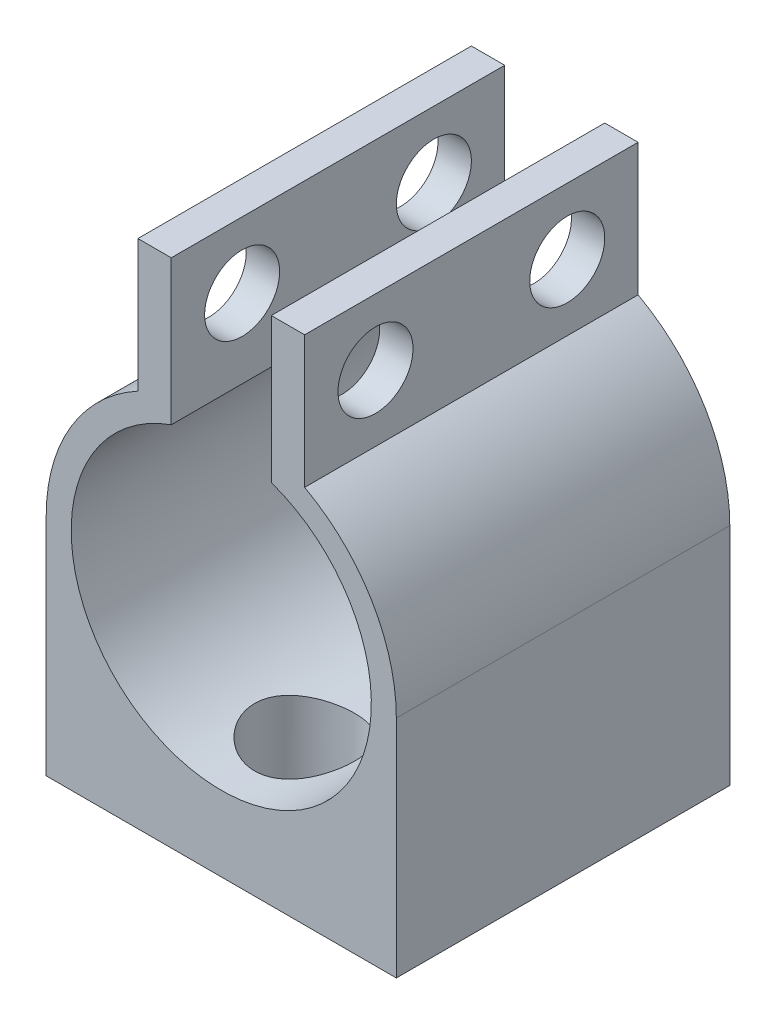
ISO-10303-21;
HEADER;
FILE_DESCRIPTION(('STEP AP214'),'2;1');
FILE_NAME('part.step','',(''),(''),'','','');
FILE_SCHEMA(('AUTOMOTIVE_DESIGN { 1 0 10303 214 1 1 1 1 }'));
ENDSEC;
DATA;
#1=APPLICATION_CONTEXT('core data for automotive mechanical design processes');
#2=APPLICATION_PROTOCOL_DEFINITION('international standard','automotive_design',2000,#1);
#3=PRODUCT_CONTEXT('',#1,'mechanical');
#4=PRODUCT('Part','Part','',(#3));
#5=PRODUCT_RELATED_PRODUCT_CATEGORY('part','',(#4));
#6=PRODUCT_DEFINITION_FORMATION('','',#4);
#7=PRODUCT_DEFINITION_CONTEXT('part definition',#1,'design');
#8=PRODUCT_DEFINITION('design','',#6,#7);
#9=PRODUCT_DEFINITION_SHAPE('','',#8);
#10=(LENGTH_UNIT() NAMED_UNIT(*) SI_UNIT(.MILLI.,.METRE.));
#11=(NAMED_UNIT(*) PLANE_ANGLE_UNIT() SI_UNIT($,.RADIAN.));
#12=(NAMED_UNIT(*) SI_UNIT($,.STERADIAN.) SOLID_ANGLE_UNIT());
#13=UNCERTAINTY_MEASURE_WITH_UNIT(LENGTH_MEASURE(1.E-05),#10,'distance_accuracy_value','');
#14=(GEOMETRIC_REPRESENTATION_CONTEXT(3) GLOBAL_UNCERTAINTY_ASSIGNED_CONTEXT((#13)) GLOBAL_UNIT_ASSIGNED_CONTEXT((#10,
#11,#12)) REPRESENTATION_CONTEXT('',''));
#15=CARTESIAN_POINT('',(0.,0.,0.));
#16=DIRECTION('',(0.,0.,1.));
#17=DIRECTION('',(1.,0.,0.));
#18=AXIS2_PLACEMENT_3D('',#15,#16,#17);
#19=CARTESIAN_POINT('',(0.,0.,20.));
#20=DIRECTION('',(0.,0.,-1.));
#21=DIRECTION('',(-1.,0.,0.));
#22=AXIS2_PLACEMENT_3D('',#19,#20,#21);
#23=CYLINDRICAL_SURFACE('',#22,9.);
#24=CARTESIAN_POINT('',(-3.,-8.48528137423857,5.));
#25=CARTESIAN_POINT('',(-3.00000077384314,-8.48528083591301,4.83659547549178));
#26=CARTESIAN_POINT('',(-2.98660435105656,-8.49005307872572,4.67319560052922));
#27=CARTESIAN_POINT('',(-2.93355339506642,-8.50852722243764,4.35123673701725));
#28=CARTESIAN_POINT('',(-2.89389453650519,-8.52223059426566,4.19267855038259));
#29=CARTESIAN_POINT('',(-2.78986645705471,-8.55684611066375,3.88511932100814));
#30=CARTESIAN_POINT('',(-2.72554566420973,-8.57774411913966,3.73610021167185));
#31=CARTESIAN_POINT('',(-2.57418488532414,-8.62437366030974,3.45091985435612));
#32=CARTESIAN_POINT('',(-2.48713988658055,-8.65010625910837,3.31476145233911));
#33=CARTESIAN_POINT('',(-2.28915343932863,-8.70463468222419,3.05384011298506));
#34=CARTESIAN_POINT('',(-2.17747302413375,-8.73350684533932,2.92965371398482));
#35=CARTESIAN_POINT('',(-1.93496300164318,-8.79041594403009,2.70137959632608));
#36=CARTESIAN_POINT('',(-1.80413032515712,-8.81845274486885,2.59729510525289));
#37=CARTESIAN_POINT('',(-1.52281352389503,-8.87141600765397,2.40956330801122));
#38=CARTESIAN_POINT('',(-1.37190573367357,-8.89624223104816,2.32652008814613));
#39=CARTESIAN_POINT('',(-1.05729366896242,-8.93908760312949,2.18722524461747));
#40=CARTESIAN_POINT('',(-0.893592857061633,-8.95710858609006,2.13096640046928));
#41=CARTESIAN_POINT('',(-0.56408645230048,-8.9837722629572,2.04879243610282));
#42=CARTESIAN_POINT('',(-0.398552264558902,-8.99271944332677,2.02188966122898));
#43=CARTESIAN_POINT('',(-0.0650936244722654,-9.00130824654743,1.99605111991802));
#44=CARTESIAN_POINT('',(0.102830200631692,-9.00095226788686,1.99710814504276));
#45=CARTESIAN_POINT('',(0.429310545581447,-8.99118118856194,2.02653276369808));
#46=CARTESIAN_POINT('',(0.587976145774973,-8.98212194265352,2.05382758542347));
#47=CARTESIAN_POINT('',(0.898330316466519,-8.95640902019195,2.13317894294142));
#48=CARTESIAN_POINT('',(1.05001841333765,-8.93975482893545,2.18523715693948));
#49=CARTESIAN_POINT('',(1.34445742452592,-8.90027010879673,2.31326395191818));
#50=CARTESIAN_POINT('',(1.48706466290654,-8.87736127572046,2.38953781563954));
#51=CARTESIAN_POINT('',(1.75777297658197,-8.82775179116757,2.56357911634597));
#52=CARTESIAN_POINT('',(1.88587000315603,-8.801050086044,2.66135252998289));
#53=CARTESIAN_POINT('',(2.13030259965393,-8.7451857554969,2.8810231803791));
#54=CARTESIAN_POINT('',(2.24580047119582,-8.71596645506633,3.00383947352444));
#55=CARTESIAN_POINT('',(2.45483177879452,-8.65942005746702,3.26734617717986));
#56=CARTESIAN_POINT('',(2.54836182984463,-8.63209325236846,3.40803933718413));
#57=CARTESIAN_POINT('',(2.71196236510723,-8.58211575363337,3.70596087681032));
#58=CARTESIAN_POINT('',(2.78167939086402,-8.55953727854243,3.86339639395332));
#59=CARTESIAN_POINT('',(2.89332957980801,-8.52244952473154,4.18871418264325));
#60=CARTESIAN_POINT('',(2.93527438724248,-8.50793686461278,4.35659204361874));
#61=CARTESIAN_POINT('',(2.98848384629257,-8.48938908946755,4.68991506623472));
#62=CARTESIAN_POINT('',(3.0010472865229,-8.48491080956268,4.85512827424597));
#63=CARTESIAN_POINT('',(2.99881631672916,-8.48570016177553,5.18532844734232));
#64=CARTESIAN_POINT('',(2.98402687568029,-8.49096602375443,5.35031544807196));
#65=CARTESIAN_POINT('',(2.92867695465693,-8.51020854270898,5.66947089713573));
#66=CARTESIAN_POINT('',(2.88901918194205,-8.52387976322521,5.82381629045252));
#67=CARTESIAN_POINT('',(2.7861415876814,-8.55805661013069,6.12363081871755));
#68=CARTESIAN_POINT('',(2.72291758909027,-8.57856344804518,6.26909837477234));
#69=CARTESIAN_POINT('',(2.57242302221681,-8.6249063278736,6.55214126254099));
#70=CARTESIAN_POINT('',(2.48445335507549,-8.65089076996885,6.6893199279254));
#71=CARTESIAN_POINT('',(2.28775689167268,-8.70497306192896,6.94743815715116));
#72=CARTESIAN_POINT('',(2.17902397649635,-8.73307153331383,7.06837291598366));
#73=CARTESIAN_POINT('',(1.93767511770098,-8.78985115913547,7.29658395227191));
#74=CARTESIAN_POINT('',(1.80416181163996,-8.81849530733689,7.40292317005655));
#75=CARTESIAN_POINT('',(1.52048187420077,-8.87180554839326,7.59174842704413));
#76=CARTESIAN_POINT('',(1.37031583459366,-8.89647178253084,7.67423531348727));
#77=CARTESIAN_POINT('',(1.05833958729689,-8.93893217431809,7.81226031458515));
#78=CARTESIAN_POINT('',(0.896613369963594,-8.95677090013593,7.8679738314442));
#79=CARTESIAN_POINT('',(0.565375397538053,-8.98375832513323,7.95118322618031));
#80=CARTESIAN_POINT('',(0.395866475861672,-8.99291016102056,7.97868928964151));
#81=CARTESIAN_POINT('',(0.0624460075801261,-9.00125589708769,8.00378623281693));
#82=CARTESIAN_POINT('',(-0.101354171760052,-9.00089760268317,8.00272236179713));
#83=CARTESIAN_POINT('',(-0.426333435000518,-8.99136589558194,7.97402807556077));
#84=CARTESIAN_POINT('',(-0.587512730457166,-8.98219319800727,7.94639981554169));
#85=CARTESIAN_POINT('',(-0.900126358296173,-8.95622744863237,7.86625329627211));
#86=CARTESIAN_POINT('',(-1.05167481273836,-8.93955775083445,7.8141373539412));
#87=CARTESIAN_POINT('',(-1.34393505281938,-8.90031482113485,7.68686740670854));
#88=CARTESIAN_POINT('',(-1.48464487242729,-8.87774052144049,7.61170923440896));
#89=CARTESIAN_POINT('',(-1.75690204892635,-8.82797606483643,7.43729146369398));
#90=CARTESIAN_POINT('',(-1.88791875467282,-8.8006461747578,7.33724394385508));
#91=CARTESIAN_POINT('',(-2.13174307881728,-8.74478966375638,7.11722782653142));
#92=CARTESIAN_POINT('',(-2.24454486487377,-8.71626266319291,6.99725287321182));
#93=CARTESIAN_POINT('',(-2.45322542649935,-8.65989839476794,6.73517193323916));
#94=CARTESIAN_POINT('',(-2.5482688979937,-8.63213183965892,6.59238346707008));
#95=CARTESIAN_POINT('',(-2.71294302990334,-8.58180579969046,6.29199671929166));
#96=CARTESIAN_POINT('',(-2.78258033045842,-8.55924495483748,6.13440232091101));
#97=CARTESIAN_POINT('',(-2.89153148461249,-8.52304002619544,5.81611452795311));
#98=CARTESIAN_POINT('',(-2.93207372744856,-8.50903898571547,5.6558832094239));
#99=CARTESIAN_POINT('',(-2.9863029604478,-8.49016150618555,5.3304318485999));
#100=CARTESIAN_POINT('',(-2.99999921758977,-8.48528191852383,5.16521354776787));
#101=CARTESIAN_POINT('',(-3.,-8.48528137423857,5.));
#102=B_SPLINE_CURVE_WITH_KNOTS('',3,(#24,#25,#26,#27,#28,#29,#30,#31,#32,#33,#34,#35,#36,#37,
#38,#39,#40,#41,#42,#43,#44,#45,#46,#47,#48,#49,#50,#51,#52,#53,#54,#55,#56,#57,#58,#59,#60,#61,
#62,#63,#64,#65,#66,#67,#68,#69,#70,#71,#72,#73,#74,#75,#76,#77,#78,#79,#80,#81,#82,#83,#84,#85,
#86,#87,#88,#89,#90,#91,#92,#93,#94,#95,#96,#97,#98,#99,#100,#101),.UNSPECIFIED.,.T.,.F.,(4,2,2,
2,2,2,2,2,2,2,2,2,2,2,2,2,2,2,2,2,2,2,2,2,2,2,2,2,2,2,2,2,2,2,2,2,2,2,4),(0.,0.489601754398068,
0.979284165045491,1.46800988250248,1.95684349855633,2.46304012282704,2.96931795515964,
3.48880518430971,4.00815229160367,4.50942956294803,5.01057759906982,5.49207014476707,
5.9735953256771,6.46144964581005,6.94943975622066,7.46040523091753,7.97144938836318,
8.48977919529166,9.00789154069847,9.50262874093319,9.99727607511701,10.4749318730633,
10.9526723744084,11.4455657320714,11.9386045698638,12.4553642451328,12.972105562726,
13.4854137357255,13.9985364901247,14.4875425403291,14.9765089202934,15.4577086812129,
15.9389955228973,16.438065585619,16.9372951329789,17.4560670820843,17.974703348006,
18.4698963648807,18.9649184157139),.UNSPECIFIED.);
#103=CARTESIAN_POINT('',(-3.,-8.48528137423857,5.));
#104=VERTEX_POINT('',#103);
#105=EDGE_CURVE('E226',#104,#104,#102,.T.);
#106=ORIENTED_EDGE('',*,*,#105,.T.);
#107=EDGE_LOOP('',(#106));
#108=FACE_BOUND('',#107,.T.);
#109=CARTESIAN_POINT('',(0.,0.,0.));
#110=DIRECTION('',(0.,0.,1.));
#111=DIRECTION('',(1.,0.,0.));
#112=AXIS2_PLACEMENT_3D('',#109,#110,#111);
#113=CIRCLE('',#112,9.);
#114=CARTESIAN_POINT('',(-3.,8.48528137423857,0.));
#115=VERTEX_POINT('',#114);
#116=CARTESIAN_POINT('',(3.,8.48528137423857,0.));
#117=VERTEX_POINT('',#116);
#118=EDGE_CURVE('E195',#115,#117,#113,.T.);
#119=ORIENTED_EDGE('',*,*,#118,.F.);
#120=DIRECTION('',(0.,0.,-1.));
#121=VECTOR('',#120,1.);
#122=CARTESIAN_POINT('',(-3.,8.48528137423857,20.));
#123=LINE('',#122,#121);
#124=CARTESIAN_POINT('',(-3.,8.48528137423857,20.));
#125=VERTEX_POINT('',#124);
#126=EDGE_CURVE('E105',#125,#115,#123,.T.);
#127=ORIENTED_EDGE('',*,*,#126,.F.);
#128=CARTESIAN_POINT('',(0.,0.,20.));
#129=DIRECTION('',(0.,0.,1.));
#130=DIRECTION('',(1.,0.,0.));
#131=AXIS2_PLACEMENT_3D('',#128,#129,#130);
#132=CIRCLE('',#131,9.);
#133=CARTESIAN_POINT('',(3.,8.48528137423857,20.));
#134=VERTEX_POINT('',#133);
#135=EDGE_CURVE('E157',#125,#134,#132,.T.);
#136=ORIENTED_EDGE('',*,*,#135,.T.);
#137=DIRECTION('',(0.,0.,-1.));
#138=VECTOR('',#137,1.);
#139=CARTESIAN_POINT('',(3.,8.48528137423857,20.));
#140=LINE('',#139,#138);
#141=EDGE_CURVE('E143',#134,#117,#140,.T.);
#142=ORIENTED_EDGE('',*,*,#141,.T.);
#143=EDGE_LOOP('',(#119,#127,#136,#142));
#144=FACE_BOUND('',#143,.T.);
#145=CARTESIAN_POINT('',(-3.,-8.48528137423857,15.));
#146=CARTESIAN_POINT('',(-3.00000077384314,-8.48528083591301,14.8365954754918));
#147=CARTESIAN_POINT('',(-2.98660435105656,-8.49005307872572,14.6731956005292));
#148=CARTESIAN_POINT('',(-2.93355339506642,-8.50852722243764,14.3512367370173));
#149=CARTESIAN_POINT('',(-2.89389453650519,-8.52223059426566,14.1926785503826));
#150=CARTESIAN_POINT('',(-2.78986645705471,-8.55684611066375,13.8851193210081));
#151=CARTESIAN_POINT('',(-2.72554566420973,-8.57774411913966,13.7361002116718));
#152=CARTESIAN_POINT('',(-2.57418488532414,-8.62437366030974,13.4509198543561));
#153=CARTESIAN_POINT('',(-2.48713988658055,-8.65010625910837,13.3147614523391));
#154=CARTESIAN_POINT('',(-2.28915343932863,-8.70463468222419,13.0538401129851));
#155=CARTESIAN_POINT('',(-2.17747302413375,-8.73350684533932,12.9296537139848));
#156=CARTESIAN_POINT('',(-1.93496300164318,-8.79041594403009,12.7013795963261));
#157=CARTESIAN_POINT('',(-1.80413032515712,-8.81845274486885,12.5972951052529));
#158=CARTESIAN_POINT('',(-1.52281352389503,-8.87141600765397,12.4095633080112));
#159=CARTESIAN_POINT('',(-1.37190573367357,-8.89624223104816,12.3265200881461));
#160=CARTESIAN_POINT('',(-1.05729366896242,-8.93908760312949,12.1872252446175));
#161=CARTESIAN_POINT('',(-0.893592857061632,-8.95710858609006,12.1309664004693));
#162=CARTESIAN_POINT('',(-0.56408645230048,-8.9837722629572,12.0487924361028));
#163=CARTESIAN_POINT('',(-0.398552264558902,-8.99271944332677,12.021889661229));
#164=CARTESIAN_POINT('',(-0.0650936244722654,-9.00130824654743,11.996051119918));
#165=CARTESIAN_POINT('',(0.102830200631692,-9.00095226788686,11.9971081450428));
#166=CARTESIAN_POINT('',(0.429310545581448,-8.99118118856194,12.0265327636981));
#167=CARTESIAN_POINT('',(0.587976145774974,-8.98212194265352,12.0538275854235));
#168=CARTESIAN_POINT('',(0.898330316466519,-8.95640902019195,12.1331789429414));
#169=CARTESIAN_POINT('',(1.05001841333765,-8.93975482893545,12.1852371569395));
#170=CARTESIAN_POINT('',(1.34445742452592,-8.90027010879673,12.3132639519182));
#171=CARTESIAN_POINT('',(1.48706466290654,-8.87736127572046,12.3895378156395));
#172=CARTESIAN_POINT('',(1.75777297658197,-8.82775179116757,12.563579116346));
#173=CARTESIAN_POINT('',(1.88587000315603,-8.801050086044,12.6613525299829));
#174=CARTESIAN_POINT('',(2.13030259965393,-8.74518575549689,12.8810231803791));
#175=CARTESIAN_POINT('',(2.24580047119582,-8.71596645506633,13.0038394735244));
#176=CARTESIAN_POINT('',(2.45483177879453,-8.65942005746702,13.2673461771799));
#177=CARTESIAN_POINT('',(2.54836182984463,-8.63209325236846,13.4080393371841));
#178=CARTESIAN_POINT('',(2.71196236510723,-8.58211575363337,13.7059608768103));
#179=CARTESIAN_POINT('',(2.78167939086402,-8.55953727854243,13.8633963939533));
#180=CARTESIAN_POINT('',(2.89332957980801,-8.52244952473154,14.1887141826433));
#181=CARTESIAN_POINT('',(2.93527438724248,-8.50793686461278,14.3565920436187));
#182=CARTESIAN_POINT('',(2.98848384629257,-8.48938908946755,14.6899150662347));
#183=CARTESIAN_POINT('',(3.0010472865229,-8.48491080956268,14.855128274246));
#184=CARTESIAN_POINT('',(2.99881631672916,-8.48570016177553,15.1853284473423));
#185=CARTESIAN_POINT('',(2.98402687568029,-8.49096602375443,15.350315448072));
#186=CARTESIAN_POINT('',(2.92867695465693,-8.51020854270898,15.6694708971357));
#187=CARTESIAN_POINT('',(2.88901918194205,-8.52387976322521,15.8238162904525));
#188=CARTESIAN_POINT('',(2.7861415876814,-8.55805661013069,16.1236308187176));
#189=CARTESIAN_POINT('',(2.72291758909027,-8.57856344804518,16.2690983747723));
#190=CARTESIAN_POINT('',(2.57242302221681,-8.6249063278736,16.552141262541));
#191=CARTESIAN_POINT('',(2.48445335507549,-8.65089076996885,16.6893199279254));
#192=CARTESIAN_POINT('',(2.28775689167268,-8.70497306192896,16.9474381571512));
#193=CARTESIAN_POINT('',(2.17902397649635,-8.73307153331383,17.0683729159837));
#194=CARTESIAN_POINT('',(1.93767511770098,-8.78985115913547,17.2965839522719));
#195=CARTESIAN_POINT('',(1.80416181163996,-8.81849530733689,17.4029231700565));
#196=CARTESIAN_POINT('',(1.52048187420077,-8.87180554839326,17.5917484270441));
#197=CARTESIAN_POINT('',(1.37031583459366,-8.89647178253084,17.6742353134873));
#198=CARTESIAN_POINT('',(1.05833958729689,-8.93893217431809,17.8122603145851));
#199=CARTESIAN_POINT('',(0.896613369963592,-8.95677090013593,17.8679738314442));
#200=CARTESIAN_POINT('',(0.565375397538051,-8.98375832513324,17.9511832261803));
#201=CARTESIAN_POINT('',(0.39586647586167,-8.99291016102056,17.9786892896415));
#202=CARTESIAN_POINT('',(0.0624460075801244,-9.00125589708769,18.0037862328169));
#203=CARTESIAN_POINT('',(-0.101354171760054,-9.00089760268317,18.0027223617971));
#204=CARTESIAN_POINT('',(-0.42633343500052,-8.99136589558194,17.9740280755608));
#205=CARTESIAN_POINT('',(-0.587512730457168,-8.98219319800727,17.9463998155417));
#206=CARTESIAN_POINT('',(-0.900126358296174,-8.95622744863237,17.8662532962721));
#207=CARTESIAN_POINT('',(-1.05167481273837,-8.93955775083445,17.8141373539412));
#208=CARTESIAN_POINT('',(-1.34393505281938,-8.90031482113485,17.6868674067085));
#209=CARTESIAN_POINT('',(-1.48464487242729,-8.87774052144049,17.611709234409));
#210=CARTESIAN_POINT('',(-1.75690204892635,-8.82797606483643,17.437291463694));
#211=CARTESIAN_POINT('',(-1.88791875467282,-8.80064617475779,17.3372439438551));
#212=CARTESIAN_POINT('',(-2.13174307881728,-8.74478966375639,17.1172278265314));
#213=CARTESIAN_POINT('',(-2.24454486487377,-8.71626266319292,16.9972528732118));
#214=CARTESIAN_POINT('',(-2.45322542649935,-8.65989839476795,16.7351719332392));
#215=CARTESIAN_POINT('',(-2.5482688979937,-8.63213183965892,16.5923834670701));
#216=CARTESIAN_POINT('',(-2.71294302990334,-8.58180579969046,16.2919967192917));
#217=CARTESIAN_POINT('',(-2.78258033045842,-8.55924495483748,16.134402320911));
#218=CARTESIAN_POINT('',(-2.89153148461249,-8.52304002619544,15.8161145279531));
#219=CARTESIAN_POINT('',(-2.93207372744855,-8.50903898571547,15.6558832094239));
#220=CARTESIAN_POINT('',(-2.9863029604478,-8.49016150618555,15.3304318485999));
#221=CARTESIAN_POINT('',(-2.99999921758977,-8.48528191852383,15.1652135477679));
#222=CARTESIAN_POINT('',(-3.,-8.48528137423857,15.));
#223=B_SPLINE_CURVE_WITH_KNOTS('',3,(#145,#146,#147,#148,#149,#150,#151,#152,#153,#154,#155,
#156,#157,#158,#159,#160,#161,#162,#163,#164,#165,#166,#167,#168,#169,#170,#171,#172,#173,#174,
#175,#176,#177,#178,#179,#180,#181,#182,#183,#184,#185,#186,#187,#188,#189,#190,#191,#192,#193,
#194,#195,#196,#197,#198,#199,#200,#201,#202,#203,#204,#205,#206,#207,#208,#209,#210,#211,#212,
#213,#214,#215,#216,#217,#218,#219,#220,#221,#222),.UNSPECIFIED.,.T.,.F.,(4,2,2,2,2,2,2,2,2,2,2,
2,2,2,2,2,2,2,2,2,2,2,2,2,2,2,2,2,2,2,2,2,2,2,2,2,2,2,4),(0.,0.489601754398066,
0.979284165045492,1.46800988250249,1.95684349855633,2.46304012282704,2.96931795515964,
3.48880518430972,4.00815229160367,4.50942956294803,5.01057759906982,5.49207014476707,
5.9735953256771,6.46144964581005,6.94943975622066,7.46040523091753,7.97144938836318,
8.48977919529167,9.00789154069847,9.50262874093319,9.99727607511702,10.4749318730633,
10.9526723744084,11.4455657320715,11.9386045698638,12.4553642451328,12.972105562726,
13.4854137357256,13.9985364901247,14.4875425403291,14.9765089202934,15.4577086812129,
15.9389955228973,16.438065585619,16.937295132979,17.4560670820843,17.974703348006,
18.4698963648807,18.9649184157139),.UNSPECIFIED.);
#224=CARTESIAN_POINT('',(-3.,-8.48528137423857,15.));
#225=VERTEX_POINT('',#224);
#226=EDGE_CURVE('E45',#225,#225,#223,.T.);
#227=ORIENTED_EDGE('',*,*,#226,.T.);
#228=EDGE_LOOP('',(#227));
#229=FACE_BOUND('',#228,.T.);
#230=ADVANCED_FACE('F41',(#108,#144,#229),#23,.F.);
#231=CARTESIAN_POINT('',(-3.,17.1595193338359,20.));
#232=DIRECTION('',(0.,-1.,0.));
#233=DIRECTION('',(0.,0.,-1.));
#234=AXIS2_PLACEMENT_3D('',#231,#232,#233);
#235=PLANE('',#234);
#236=DIRECTION('',(-1.,0.,0.));
#237=VECTOR('',#236,1.);
#238=CARTESIAN_POINT('',(-3.,17.1595193338359,0.));
#239=LINE('',#238,#237);
#240=CARTESIAN_POINT('',(-3.,17.1595193338359,0.));
#241=VERTEX_POINT('',#240);
#242=CARTESIAN_POINT('',(-5.,17.1595193338359,0.));
#243=VERTEX_POINT('',#242);
#244=EDGE_CURVE('E168',#241,#243,#239,.T.);
#245=ORIENTED_EDGE('',*,*,#244,.T.);
#246=DIRECTION('',(0.,0.,-1.));
#247=VECTOR('',#246,1.);
#248=CARTESIAN_POINT('',(-5.,17.1595193338359,20.));
#249=LINE('',#248,#247);
#250=CARTESIAN_POINT('',(-5.,17.1595193338359,20.));
#251=VERTEX_POINT('',#250);
#252=EDGE_CURVE('E11',#251,#243,#249,.T.);
#253=ORIENTED_EDGE('',*,*,#252,.F.);
#254=DIRECTION('',(-1.,0.,0.));
#255=VECTOR('',#254,1.);
#256=CARTESIAN_POINT('',(-3.,17.1595193338359,20.));
#257=LINE('',#256,#255);
#258=CARTESIAN_POINT('',(-3.,17.1595193338359,20.));
#259=VERTEX_POINT('',#258);
#260=EDGE_CURVE('E198',#259,#251,#257,.T.);
#261=ORIENTED_EDGE('',*,*,#260,.F.);
#262=DIRECTION('',(0.,0.,-1.));
#263=VECTOR('',#262,1.);
#264=CARTESIAN_POINT('',(-3.,17.1595193338359,20.));
#265=LINE('',#264,#263);
#266=EDGE_CURVE('E164',#259,#241,#265,.T.);
#267=ORIENTED_EDGE('',*,*,#266,.T.);
#268=EDGE_LOOP('',(#245,#253,#261,#267));
#269=FACE_BOUND('',#268,.T.);
#270=ADVANCED_FACE('F43',(#269),#235,.F.);
#271=CARTESIAN_POINT('',(-5.,17.1595193338359,20.));
#272=DIRECTION('',(1.,0.,0.));
#273=DIRECTION('',(0.,1.,0.));
#274=AXIS2_PLACEMENT_3D('',#271,#272,#273);
#275=PLANE('',#274);
#276=CARTESIAN_POINT('',(-5.,13.1963059950728,15.75));
#277=DIRECTION('',(1.,0.,0.));
#278=DIRECTION('',(0.,1.,0.));
#279=AXIS2_PLACEMENT_3D('',#276,#277,#278);
#280=CIRCLE('',#279,2.25);
#281=CARTESIAN_POINT('',(-5.,15.4463059950728,15.75));
#282=VERTEX_POINT('',#281);
#283=EDGE_CURVE('E172',#282,#282,#280,.T.);
#284=ORIENTED_EDGE('',*,*,#283,.T.);
#285=EDGE_LOOP('',(#284));
#286=FACE_BOUND('',#285,.T.);
#287=CARTESIAN_POINT('',(-5.,13.1963059950728,4.25));
#288=DIRECTION('',(1.,0.,0.));
#289=DIRECTION('',(0.,1.,0.));
#290=AXIS2_PLACEMENT_3D('',#287,#288,#289);
#291=CIRCLE('',#290,2.25);
#292=CARTESIAN_POINT('',(-5.,15.4463059950728,4.25));
#293=VERTEX_POINT('',#292);
#294=EDGE_CURVE('E225',#293,#293,#291,.T.);
#295=ORIENTED_EDGE('',*,*,#294,.T.);
#296=EDGE_LOOP('',(#295));
#297=FACE_BOUND('',#296,.T.);
#298=DIRECTION('',(0.,-1.,0.));
#299=VECTOR('',#298,1.);
#300=CARTESIAN_POINT('',(-5.,17.1595193338359,0.));
#301=LINE('',#300,#299);
#302=CARTESIAN_POINT('',(-5.,9.23309265630969,0.));
#303=VERTEX_POINT('',#302);
#304=EDGE_CURVE('E171',#243,#303,#301,.T.);
#305=ORIENTED_EDGE('',*,*,#304,.T.);
#306=DIRECTION('',(0.,0.,-1.));
#307=VECTOR('',#306,1.);
#308=CARTESIAN_POINT('',(-5.,9.23309265630969,20.));
#309=LINE('',#308,#307);
#310=CARTESIAN_POINT('',(-5.,9.23309265630969,20.));
#311=VERTEX_POINT('',#310);
#312=EDGE_CURVE('E56',#311,#303,#309,.T.);
#313=ORIENTED_EDGE('',*,*,#312,.F.);
#314=DIRECTION('',(0.,-1.,0.));
#315=VECTOR('',#314,1.);
#316=CARTESIAN_POINT('',(-5.,17.1595193338359,20.));
#317=LINE('',#316,#315);
#318=EDGE_CURVE('E116',#251,#311,#317,.T.);
#319=ORIENTED_EDGE('',*,*,#318,.F.);
#320=ORIENTED_EDGE('',*,*,#252,.T.);
#321=EDGE_LOOP('',(#305,#313,#319,#320));
#322=FACE_BOUND('',#321,.T.);
#323=ADVANCED_FACE('F274',(#286,#297,#322),#275,.F.);
#324=CARTESIAN_POINT('',(0.,0.,20.));
#325=DIRECTION('',(0.,0.,-1.));
#326=DIRECTION('',(-1.,0.,0.));
#327=AXIS2_PLACEMENT_3D('',#324,#325,#326);
#328=CYLINDRICAL_SURFACE('',#327,10.5);
#329=CARTESIAN_POINT('',(0.,0.,0.));
#330=DIRECTION('',(0.,0.,1.));
#331=DIRECTION('',(1.,0.,0.));
#332=AXIS2_PLACEMENT_3D('',#329,#330,#331);
#333=CIRCLE('',#332,10.5);
#334=CARTESIAN_POINT('',(-10.5,0.,0.));
#335=VERTEX_POINT('',#334);
#336=EDGE_CURVE('E174',#303,#335,#333,.T.);
#337=ORIENTED_EDGE('',*,*,#336,.T.);
#338=DIRECTION('',(0.,0.,-1.));
#339=VECTOR('',#338,1.);
#340=CARTESIAN_POINT('',(-10.5,0.,20.));
#341=LINE('',#340,#339);
#342=CARTESIAN_POINT('',(-10.5,0.,20.));
#343=VERTEX_POINT('',#342);
#344=EDGE_CURVE('E212',#343,#335,#341,.T.);
#345=ORIENTED_EDGE('',*,*,#344,.F.);
#346=CARTESIAN_POINT('',(0.,0.,20.));
#347=DIRECTION('',(0.,0.,1.));
#348=DIRECTION('',(1.,0.,0.));
#349=AXIS2_PLACEMENT_3D('',#346,#347,#348);
#350=CIRCLE('',#349,10.5);
#351=EDGE_CURVE('E292',#311,#343,#350,.T.);
#352=ORIENTED_EDGE('',*,*,#351,.F.);
#353=ORIENTED_EDGE('',*,*,#312,.T.);
#354=EDGE_LOOP('',(#337,#345,#352,#353));
#355=FACE_BOUND('',#354,.T.);
#356=ADVANCED_FACE('F282',(#355),#328,.T.);
#357=CARTESIAN_POINT('',(-10.5,0.,20.));
#358=DIRECTION('',(1.,0.,0.));
#359=DIRECTION('',(0.,0.,-1.));
#360=AXIS2_PLACEMENT_3D('',#357,#358,#359);
#361=PLANE('',#360);
#362=DIRECTION('',(0.,-1.,0.));
#363=VECTOR('',#362,1.);
#364=CARTESIAN_POINT('',(-10.5,0.,0.));
#365=LINE('',#364,#363);
#366=CARTESIAN_POINT('',(-10.5,-13.5,0.));
#367=VERTEX_POINT('',#366);
#368=EDGE_CURVE('E176',#335,#367,#365,.T.);
#369=ORIENTED_EDGE('',*,*,#368,.T.);
#370=DIRECTION('',(0.,0.,-1.));
#371=VECTOR('',#370,1.);
#372=CARTESIAN_POINT('',(-10.5,-13.5,20.));
#373=LINE('',#372,#371);
#374=CARTESIAN_POINT('',(-10.5,-13.5,20.));
#375=VERTEX_POINT('',#374);
#376=EDGE_CURVE('E210',#375,#367,#373,.T.);
#377=ORIENTED_EDGE('',*,*,#376,.F.);
#378=DIRECTION('',(0.,-1.,0.));
#379=VECTOR('',#378,1.);
#380=CARTESIAN_POINT('',(-10.5,0.,20.));
#381=LINE('',#380,#379);
#382=EDGE_CURVE('E294',#343,#375,#381,.T.);
#383=ORIENTED_EDGE('',*,*,#382,.F.);
#384=ORIENTED_EDGE('',*,*,#344,.T.);
#385=EDGE_LOOP('',(#369,#377,#383,#384));
#386=FACE_BOUND('',#385,.T.);
#387=ADVANCED_FACE('F330',(#386),#361,.F.);
#388=CARTESIAN_POINT('',(10.5,-13.5,20.));
#389=DIRECTION('',(0.,-1.,0.));
#390=DIRECTION('',(1.,0.,0.));
#391=AXIS2_PLACEMENT_3D('',#388,#389,#390);
#392=PLANE('',#391);
#393=CARTESIAN_POINT('',(0.,-13.5,15.));
#394=DIRECTION('',(0.,-1.,0.));
#395=DIRECTION('',(1.,0.,0.));
#396=AXIS2_PLACEMENT_3D('',#393,#394,#395);
#397=CIRCLE('',#396,3.);
#398=CARTESIAN_POINT('',(3.,-13.5,15.));
#399=VERTEX_POINT('',#398);
#400=EDGE_CURVE('E463',#399,#399,#397,.F.);
#401=ORIENTED_EDGE('',*,*,#400,.T.);
#402=EDGE_LOOP('',(#401));
#403=FACE_BOUND('',#402,.T.);
#404=CARTESIAN_POINT('',(0.,-13.5,5.));
#405=DIRECTION('',(0.,-1.,0.));
#406=DIRECTION('',(1.,0.,0.));
#407=AXIS2_PLACEMENT_3D('',#404,#405,#406);
#408=CIRCLE('',#407,3.);
#409=CARTESIAN_POINT('',(3.,-13.5,5.));
#410=VERTEX_POINT('',#409);
#411=EDGE_CURVE('E232',#410,#410,#408,.F.);
#412=ORIENTED_EDGE('',*,*,#411,.T.);
#413=EDGE_LOOP('',(#412));
#414=FACE_BOUND('',#413,.T.);
#415=DIRECTION('',(-1.,0.,0.));
#416=VECTOR('',#415,1.);
#417=CARTESIAN_POINT('',(10.5,-13.5,0.));
#418=LINE('',#417,#416);
#419=CARTESIAN_POINT('',(10.5,-13.5,0.));
#420=VERTEX_POINT('',#419);
#421=EDGE_CURVE('E179',#420,#367,#418,.T.);
#422=ORIENTED_EDGE('',*,*,#421,.F.);
#423=DIRECTION('',(0.,0.,-1.));
#424=VECTOR('',#423,1.);
#425=CARTESIAN_POINT('',(10.5,-13.5,20.));
#426=LINE('',#425,#424);
#427=CARTESIAN_POINT('',(10.5,-13.5,20.));
#428=VERTEX_POINT('',#427);
#429=EDGE_CURVE('E208',#428,#420,#426,.T.);
#430=ORIENTED_EDGE('',*,*,#429,.F.);
#431=DIRECTION('',(-1.,0.,0.));
#432=VECTOR('',#431,1.);
#433=CARTESIAN_POINT('',(10.5,-13.5,20.));
#434=LINE('',#433,#432);
#435=EDGE_CURVE('E296',#428,#375,#434,.T.);
#436=ORIENTED_EDGE('',*,*,#435,.T.);
#437=ORIENTED_EDGE('',*,*,#376,.T.);
#438=EDGE_LOOP('',(#422,#430,#436,#437));
#439=FACE_BOUND('',#438,.T.);
#440=ADVANCED_FACE('F326',(#403,#414,#439),#392,.T.);
#441=CARTESIAN_POINT('',(10.5,0.,20.));
#442=DIRECTION('',(1.,0.,0.));
#443=DIRECTION('',(0.,0.,-1.));
#444=AXIS2_PLACEMENT_3D('',#441,#442,#443);
#445=PLANE('',#444);
#446=DIRECTION('',(0.,-1.,0.));
#447=VECTOR('',#446,1.);
#448=CARTESIAN_POINT('',(10.5,0.,0.));
#449=LINE('',#448,#447);
#450=CARTESIAN_POINT('',(10.5,0.,0.));
#451=VERTEX_POINT('',#450);
#452=EDGE_CURVE('E182',#451,#420,#449,.T.);
#453=ORIENTED_EDGE('',*,*,#452,.F.);
#454=DIRECTION('',(0.,0.,-1.));
#455=VECTOR('',#454,1.);
#456=CARTESIAN_POINT('',(10.5,0.,20.));
#457=LINE('',#456,#455);
#458=CARTESIAN_POINT('',(10.5,0.,20.));
#459=VERTEX_POINT('',#458);
#460=EDGE_CURVE('E206',#459,#451,#457,.T.);
#461=ORIENTED_EDGE('',*,*,#460,.F.);
#462=DIRECTION('',(0.,-1.,0.));
#463=VECTOR('',#462,1.);
#464=CARTESIAN_POINT('',(10.5,0.,20.));
#465=LINE('',#464,#463);
#466=EDGE_CURVE('E303',#459,#428,#465,.T.);
#467=ORIENTED_EDGE('',*,*,#466,.T.);
#468=ORIENTED_EDGE('',*,*,#429,.T.);
#469=EDGE_LOOP('',(#453,#461,#467,#468));
#470=FACE_BOUND('',#469,.T.);
#471=ADVANCED_FACE('F323',(#470),#445,.T.);
#472=CARTESIAN_POINT('',(0.,0.,20.));
#473=DIRECTION('',(0.,0.,-1.));
#474=DIRECTION('',(-1.,0.,0.));
#475=AXIS2_PLACEMENT_3D('',#472,#473,#474);
#476=CYLINDRICAL_SURFACE('',#475,10.5);
#477=CARTESIAN_POINT('',(0.,0.,0.));
#478=DIRECTION('',(0.,0.,1.));
#479=DIRECTION('',(1.,0.,0.));
#480=AXIS2_PLACEMENT_3D('',#477,#478,#479);
#481=CIRCLE('',#480,10.5);
#482=CARTESIAN_POINT('',(5.,9.23309265630969,0.));
#483=VERTEX_POINT('',#482);
#484=EDGE_CURVE('E185',#451,#483,#481,.T.);
#485=ORIENTED_EDGE('',*,*,#484,.T.);
#486=DIRECTION('',(0.,0.,-1.));
#487=VECTOR('',#486,1.);
#488=CARTESIAN_POINT('',(5.,9.23309265630969,20.));
#489=LINE('',#488,#487);
#490=CARTESIAN_POINT('',(5.,9.23309265630969,20.));
#491=VERTEX_POINT('',#490);
#492=EDGE_CURVE('E204',#491,#483,#489,.T.);
#493=ORIENTED_EDGE('',*,*,#492,.F.);
#494=CARTESIAN_POINT('',(0.,0.,20.));
#495=DIRECTION('',(0.,0.,1.));
#496=DIRECTION('',(1.,0.,0.));
#497=AXIS2_PLACEMENT_3D('',#494,#495,#496);
#498=CIRCLE('',#497,10.5);
#499=EDGE_CURVE('E306',#459,#491,#498,.T.);
#500=ORIENTED_EDGE('',*,*,#499,.F.);
#501=ORIENTED_EDGE('',*,*,#460,.T.);
#502=EDGE_LOOP('',(#485,#493,#500,#501));
#503=FACE_BOUND('',#502,.T.);
#504=ADVANCED_FACE('F320',(#503),#476,.T.);
#505=CARTESIAN_POINT('',(5.,17.1595193338359,20.));
#506=DIRECTION('',(1.,0.,0.));
#507=DIRECTION('',(0.,1.,0.));
#508=AXIS2_PLACEMENT_3D('',#505,#506,#507);
#509=PLANE('',#508);
#510=CARTESIAN_POINT('',(5.,13.1963059950728,15.75));
#511=DIRECTION('',(1.,0.,0.));
#512=DIRECTION('',(0.,1.,0.));
#513=AXIS2_PLACEMENT_3D('',#510,#511,#512);
#514=CIRCLE('',#513,2.25);
#515=CARTESIAN_POINT('',(5.,15.4463059950728,15.75));
#516=VERTEX_POINT('',#515);
#517=EDGE_CURVE('E221',#516,#516,#514,.T.);
#518=ORIENTED_EDGE('',*,*,#517,.F.);
#519=EDGE_LOOP('',(#518));
#520=FACE_BOUND('',#519,.T.);
#521=CARTESIAN_POINT('',(5.,13.1963059950728,4.25));
#522=DIRECTION('',(1.,0.,0.));
#523=DIRECTION('',(0.,1.,0.));
#524=AXIS2_PLACEMENT_3D('',#521,#522,#523);
#525=CIRCLE('',#524,2.25);
#526=CARTESIAN_POINT('',(5.,15.4463059950728,4.25));
#527=VERTEX_POINT('',#526);
#528=EDGE_CURVE('E466',#527,#527,#525,.T.);
#529=ORIENTED_EDGE('',*,*,#528,.F.);
#530=EDGE_LOOP('',(#529));
#531=FACE_BOUND('',#530,.T.);
#532=DIRECTION('',(0.,-1.,0.));
#533=VECTOR('',#532,1.);
#534=CARTESIAN_POINT('',(5.,17.1595193338359,0.));
#535=LINE('',#534,#533);
#536=CARTESIAN_POINT('',(5.,17.1595193338359,0.));
#537=VERTEX_POINT('',#536);
#538=EDGE_CURVE('E188',#537,#483,#535,.T.);
#539=ORIENTED_EDGE('',*,*,#538,.F.);
#540=DIRECTION('',(0.,0.,-1.));
#541=VECTOR('',#540,1.);
#542=CARTESIAN_POINT('',(5.,17.1595193338359,20.));
#543=LINE('',#542,#541);
#544=CARTESIAN_POINT('',(5.,17.1595193338359,20.));
#545=VERTEX_POINT('',#544);
#546=EDGE_CURVE('E202',#545,#537,#543,.T.);
#547=ORIENTED_EDGE('',*,*,#546,.F.);
#548=DIRECTION('',(0.,-1.,0.));
#549=VECTOR('',#548,1.);
#550=CARTESIAN_POINT('',(5.,17.1595193338359,20.));
#551=LINE('',#550,#549);
#552=EDGE_CURVE('E308',#545,#491,#551,.T.);
#553=ORIENTED_EDGE('',*,*,#552,.T.);
#554=ORIENTED_EDGE('',*,*,#492,.T.);
#555=EDGE_LOOP('',(#539,#547,#553,#554));
#556=FACE_BOUND('',#555,.T.);
#557=ADVANCED_FACE('F316',(#520,#531,#556),#509,.T.);
#558=CARTESIAN_POINT('',(3.,17.1595193338359,20.));
#559=DIRECTION('',(0.,1.,0.));
#560=DIRECTION('',(0.,0.,1.));
#561=AXIS2_PLACEMENT_3D('',#558,#559,#560);
#562=PLANE('',#561);
#563=DIRECTION('',(1.,0.,0.));
#564=VECTOR('',#563,1.);
#565=CARTESIAN_POINT('',(3.,17.1595193338359,0.));
#566=LINE('',#565,#564);
#567=CARTESIAN_POINT('',(3.,17.1595193338359,0.));
#568=VERTEX_POINT('',#567);
#569=EDGE_CURVE('E191',#568,#537,#566,.T.);
#570=ORIENTED_EDGE('',*,*,#569,.F.);
#571=DIRECTION('',(0.,0.,-1.));
#572=VECTOR('',#571,1.);
#573=CARTESIAN_POINT('',(3.,17.1595193338359,20.));
#574=LINE('',#573,#572);
#575=CARTESIAN_POINT('',(3.,17.1595193338359,20.));
#576=VERTEX_POINT('',#575);
#577=EDGE_CURVE('E153',#576,#568,#574,.T.);
#578=ORIENTED_EDGE('',*,*,#577,.F.);
#579=DIRECTION('',(1.,0.,0.));
#580=VECTOR('',#579,1.);
#581=CARTESIAN_POINT('',(3.,17.1595193338359,20.));
#582=LINE('',#581,#580);
#583=EDGE_CURVE('E160',#576,#545,#582,.T.);
#584=ORIENTED_EDGE('',*,*,#583,.T.);
#585=ORIENTED_EDGE('',*,*,#546,.T.);
#586=EDGE_LOOP('',(#570,#578,#584,#585));
#587=FACE_BOUND('',#586,.T.);
#588=ADVANCED_FACE('F265',(#587),#562,.T.);
#589=CARTESIAN_POINT('',(3.,8.48528137423857,20.));
#590=DIRECTION('',(-1.,0.,0.));
#591=DIRECTION('',(0.,0.,1.));
#592=AXIS2_PLACEMENT_3D('',#589,#590,#591);
#593=PLANE('',#592);
#594=CARTESIAN_POINT('',(3.,13.1963059950728,15.75));
#595=DIRECTION('',(-1.,0.,0.));
#596=DIRECTION('',(0.,0.,1.));
#597=AXIS2_PLACEMENT_3D('',#594,#595,#596);
#598=CIRCLE('',#597,2.25);
#599=CARTESIAN_POINT('',(3.,13.1963059950728,18.));
#600=VERTEX_POINT('',#599);
#601=EDGE_CURVE('E224',#600,#600,#598,.T.);
#602=ORIENTED_EDGE('',*,*,#601,.F.);
#603=EDGE_LOOP('',(#602));
#604=FACE_BOUND('',#603,.T.);
#605=CARTESIAN_POINT('',(3.,13.1963059950728,4.25));
#606=DIRECTION('',(-1.,0.,0.));
#607=DIRECTION('',(0.,0.,1.));
#608=AXIS2_PLACEMENT_3D('',#605,#606,#607);
#609=CIRCLE('',#608,2.25);
#610=CARTESIAN_POINT('',(3.,13.1963059950728,6.5));
#611=VERTEX_POINT('',#610);
#612=EDGE_CURVE('E220',#611,#611,#609,.T.);
#613=ORIENTED_EDGE('',*,*,#612,.F.);
#614=EDGE_LOOP('',(#613));
#615=FACE_BOUND('',#614,.T.);
#616=DIRECTION('',(0.,1.,0.));
#617=VECTOR('',#616,1.);
#618=CARTESIAN_POINT('',(3.,8.48528137423857,0.));
#619=LINE('',#618,#617);
#620=EDGE_CURVE('E148',#117,#568,#619,.T.);
#621=ORIENTED_EDGE('',*,*,#620,.F.);
#622=ORIENTED_EDGE('',*,*,#141,.F.);
#623=DIRECTION('',(0.,1.,0.));
#624=VECTOR('',#623,1.);
#625=CARTESIAN_POINT('',(3.,8.48528137423857,20.));
#626=LINE('',#625,#624);
#627=EDGE_CURVE('E146',#134,#576,#626,.T.);
#628=ORIENTED_EDGE('',*,*,#627,.T.);
#629=ORIENTED_EDGE('',*,*,#577,.T.);
#630=EDGE_LOOP('',(#621,#622,#628,#629));
#631=FACE_BOUND('',#630,.T.);
#632=ADVANCED_FACE('F145',(#604,#615,#631),#593,.T.);
#633=CARTESIAN_POINT('',(-3.,8.48528137423857,20.));
#634=DIRECTION('',(-1.,0.,0.));
#635=DIRECTION('',(0.,0.,1.));
#636=AXIS2_PLACEMENT_3D('',#633,#634,#635);
#637=PLANE('',#636);
#638=CARTESIAN_POINT('',(-3.,13.1963059950728,15.75));
#639=DIRECTION('',(-1.,0.,0.));
#640=DIRECTION('',(0.,0.,1.));
#641=AXIS2_PLACEMENT_3D('',#638,#639,#640);
#642=CIRCLE('',#641,2.25);
#643=CARTESIAN_POINT('',(-3.,13.1963059950728,18.));
#644=VERTEX_POINT('',#643);
#645=EDGE_CURVE('E222',#644,#644,#642,.T.);
#646=ORIENTED_EDGE('',*,*,#645,.T.);
#647=EDGE_LOOP('',(#646));
#648=FACE_BOUND('',#647,.T.);
#649=CARTESIAN_POINT('',(-3.,13.1963059950728,4.25));
#650=DIRECTION('',(-1.,0.,0.));
#651=DIRECTION('',(0.,0.,1.));
#652=AXIS2_PLACEMENT_3D('',#649,#650,#651);
#653=CIRCLE('',#652,2.25);
#654=CARTESIAN_POINT('',(-3.,13.1963059950728,6.5));
#655=VERTEX_POINT('',#654);
#656=EDGE_CURVE('E217',#655,#655,#653,.T.);
#657=ORIENTED_EDGE('',*,*,#656,.T.);
#658=EDGE_LOOP('',(#657));
#659=FACE_BOUND('',#658,.T.);
#660=DIRECTION('',(0.,1.,0.));
#661=VECTOR('',#660,1.);
#662=CARTESIAN_POINT('',(-3.,8.48528137423857,0.));
#663=LINE('',#662,#661);
#664=EDGE_CURVE('E108',#115,#241,#663,.T.);
#665=ORIENTED_EDGE('',*,*,#664,.T.);
#666=ORIENTED_EDGE('',*,*,#266,.F.);
#667=DIRECTION('',(0.,1.,0.));
#668=VECTOR('',#667,1.);
#669=CARTESIAN_POINT('',(-3.,8.48528137423857,20.));
#670=LINE('',#669,#668);
#671=EDGE_CURVE('E65',#125,#259,#670,.T.);
#672=ORIENTED_EDGE('',*,*,#671,.F.);
#673=ORIENTED_EDGE('',*,*,#126,.T.);
#674=EDGE_LOOP('',(#665,#666,#672,#673));
#675=FACE_BOUND('',#674,.T.);
#676=ADVANCED_FACE('F256',(#648,#659,#675),#637,.F.);
#677=CARTESIAN_POINT('',(0.,0.,20.));
#678=DIRECTION('',(0.,0.,1.));
#679=DIRECTION('',(1.,0.,0.));
#680=AXIS2_PLACEMENT_3D('',#677,#678,#679);
#681=PLANE('',#680);
#682=ORIENTED_EDGE('',*,*,#260,.T.);
#683=ORIENTED_EDGE('',*,*,#318,.T.);
#684=ORIENTED_EDGE('',*,*,#351,.T.);
#685=ORIENTED_EDGE('',*,*,#382,.T.);
#686=ORIENTED_EDGE('',*,*,#435,.F.);
#687=ORIENTED_EDGE('',*,*,#466,.F.);
#688=ORIENTED_EDGE('',*,*,#499,.T.);
#689=ORIENTED_EDGE('',*,*,#552,.F.);
#690=ORIENTED_EDGE('',*,*,#583,.F.);
#691=ORIENTED_EDGE('',*,*,#627,.F.);
#692=ORIENTED_EDGE('',*,*,#135,.F.);
#693=ORIENTED_EDGE('',*,*,#671,.T.);
#694=EDGE_LOOP('',(#682,#683,#684,#685,#686,#687,#688,#689,#690,#691,#692,#693));
#695=FACE_BOUND('',#694,.T.);
#696=ADVANCED_FACE('F156',(#695),#681,.T.);
#697=CARTESIAN_POINT('',(0.,0.,0.));
#698=DIRECTION('',(0.,0.,1.));
#699=DIRECTION('',(1.,0.,0.));
#700=AXIS2_PLACEMENT_3D('',#697,#698,#699);
#701=PLANE('',#700);
#702=ORIENTED_EDGE('',*,*,#244,.F.);
#703=ORIENTED_EDGE('',*,*,#664,.F.);
#704=ORIENTED_EDGE('',*,*,#118,.T.);
#705=ORIENTED_EDGE('',*,*,#620,.T.);
#706=ORIENTED_EDGE('',*,*,#569,.T.);
#707=ORIENTED_EDGE('',*,*,#538,.T.);
#708=ORIENTED_EDGE('',*,*,#484,.F.);
#709=ORIENTED_EDGE('',*,*,#452,.T.);
#710=ORIENTED_EDGE('',*,*,#421,.T.);
#711=ORIENTED_EDGE('',*,*,#368,.F.);
#712=ORIENTED_EDGE('',*,*,#336,.F.);
#713=ORIENTED_EDGE('',*,*,#304,.F.);
#714=EDGE_LOOP('',(#702,#703,#704,#705,#706,#707,#708,#709,#710,#711,#712,#713));
#715=FACE_BOUND('',#714,.T.);
#716=ADVANCED_FACE('F255',(#715),#701,.F.);
#717=CARTESIAN_POINT('',(-10.5,13.1963059950728,4.25));
#718=DIRECTION('',(1.,0.,0.));
#719=DIRECTION('',(0.,1.,0.));
#720=AXIS2_PLACEMENT_3D('',#717,#718,#719);
#721=CYLINDRICAL_SURFACE('',#720,2.25);
#722=ORIENTED_EDGE('',*,*,#656,.F.);
#723=EDGE_LOOP('',(#722));
#724=FACE_BOUND('',#723,.T.);
#725=ORIENTED_EDGE('',*,*,#294,.F.);
#726=EDGE_LOOP('',(#725));
#727=FACE_BOUND('',#726,.T.);
#728=ADVANCED_FACE('F252',(#724,#727),#721,.F.);
#729=CARTESIAN_POINT('',(-10.5,13.1963059950728,15.75));
#730=DIRECTION('',(1.,0.,0.));
#731=DIRECTION('',(0.,1.,0.));
#732=AXIS2_PLACEMENT_3D('',#729,#730,#731);
#733=CYLINDRICAL_SURFACE('',#732,2.25);
#734=ORIENTED_EDGE('',*,*,#645,.F.);
#735=EDGE_LOOP('',(#734));
#736=FACE_BOUND('',#735,.T.);
#737=ORIENTED_EDGE('',*,*,#283,.F.);
#738=EDGE_LOOP('',(#737));
#739=FACE_BOUND('',#738,.T.);
#740=ADVANCED_FACE('F248',(#736,#739),#733,.F.);
#741=ORIENTED_EDGE('',*,*,#612,.T.);
#742=EDGE_LOOP('',(#741));
#743=FACE_BOUND('',#742,.T.);
#744=ORIENTED_EDGE('',*,*,#528,.T.);
#745=EDGE_LOOP('',(#744));
#746=FACE_BOUND('',#745,.T.);
#747=ADVANCED_FACE('F246',(#743,#746),#721,.F.);
#748=ORIENTED_EDGE('',*,*,#601,.T.);
#749=EDGE_LOOP('',(#748));
#750=FACE_BOUND('',#749,.T.);
#751=ORIENTED_EDGE('',*,*,#517,.T.);
#752=EDGE_LOOP('',(#751));
#753=FACE_BOUND('',#752,.T.);
#754=ADVANCED_FACE('F241',(#750,#753),#733,.F.);
#755=CARTESIAN_POINT('',(0.,-52.,5.));
#756=DIRECTION('',(0.,1.,0.));
#757=DIRECTION('',(-1.,0.,0.));
#758=AXIS2_PLACEMENT_3D('',#755,#756,#757);
#759=CYLINDRICAL_SURFACE('',#758,3.);
#760=ORIENTED_EDGE('',*,*,#411,.F.);
#761=EDGE_LOOP('',(#760));
#762=FACE_BOUND('',#761,.T.);
#763=ORIENTED_EDGE('',*,*,#105,.F.);
#764=EDGE_LOOP('',(#763));
#765=FACE_BOUND('',#764,.T.);
#766=ADVANCED_FACE('F236',(#762,#765),#759,.F.);
#767=CARTESIAN_POINT('',(0.,-52.,15.));
#768=DIRECTION('',(0.,1.,0.));
#769=DIRECTION('',(-1.,0.,0.));
#770=AXIS2_PLACEMENT_3D('',#767,#768,#769);
#771=CYLINDRICAL_SURFACE('',#770,3.);
#772=ORIENTED_EDGE('',*,*,#400,.F.);
#773=EDGE_LOOP('',(#772));
#774=FACE_BOUND('',#773,.T.);
#775=ORIENTED_EDGE('',*,*,#226,.F.);
#776=EDGE_LOOP('',(#775));
#777=FACE_BOUND('',#776,.T.);
#778=ADVANCED_FACE('F240',(#774,#777),#771,.F.);
#779=CLOSED_SHELL('',(#230,#270,#323,#356,#387,#440,#471,#504,#557,#588,#632,#676,#696,#716,
#728,#740,#747,#754,#766,#778));
#780=MANIFOLD_SOLID_BREP('B2',#779);
#781=ADVANCED_BREP_SHAPE_REPRESENTATION('',(#18,#780),#14);
#782=SHAPE_DEFINITION_REPRESENTATION(#9,#781);
ENDSEC;
END-ISO-10303-21;
